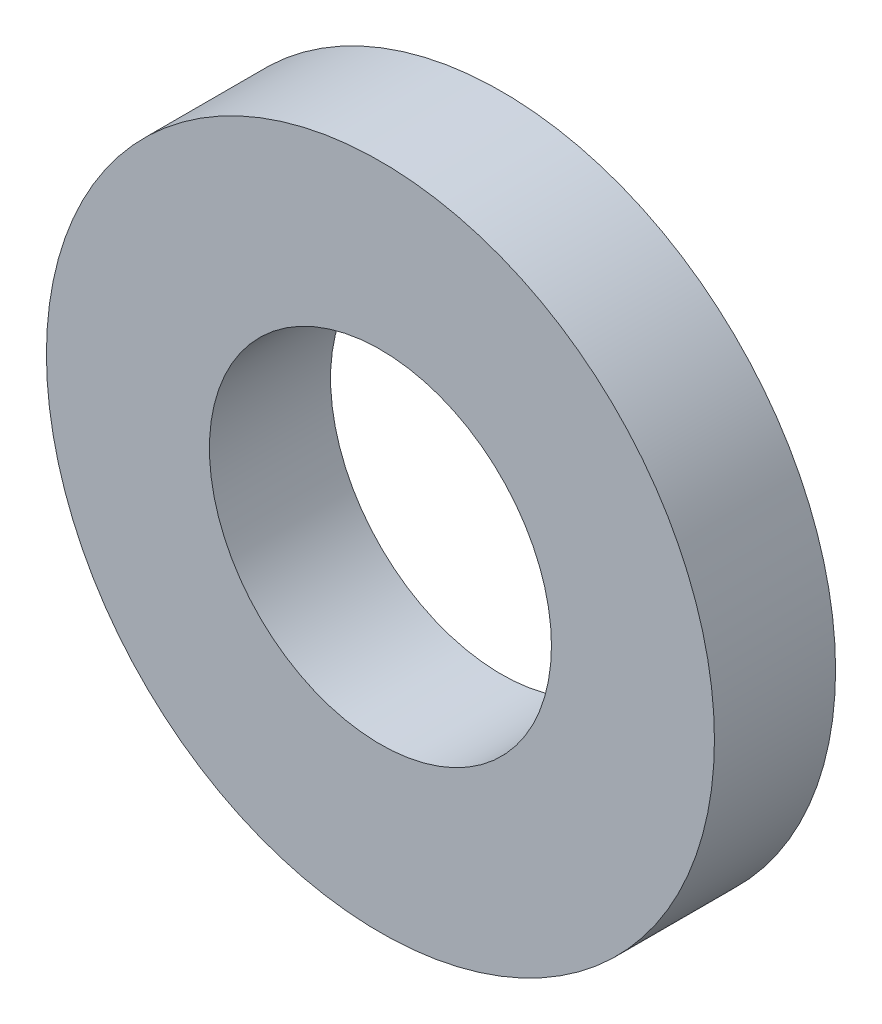
ISO-10303-21;
HEADER;
FILE_DESCRIPTION(('STEP AP214'),'2;1');
FILE_NAME('part.step','',(''),(''),'','','');
FILE_SCHEMA(('AUTOMOTIVE_DESIGN { 1 0 10303 214 1 1 1 1 }'));
ENDSEC;
DATA;
#1=APPLICATION_CONTEXT('core data for automotive mechanical design processes');
#2=APPLICATION_PROTOCOL_DEFINITION('international standard','automotive_design',2000,#1);
#3=PRODUCT_CONTEXT('',#1,'mechanical');
#4=PRODUCT('Part','Part','',(#3));
#5=PRODUCT_RELATED_PRODUCT_CATEGORY('part','',(#4));
#6=PRODUCT_DEFINITION_FORMATION('','',#4);
#7=PRODUCT_DEFINITION_CONTEXT('part definition',#1,'design');
#8=PRODUCT_DEFINITION('design','',#6,#7);
#9=PRODUCT_DEFINITION_SHAPE('','',#8);
#10=(LENGTH_UNIT() NAMED_UNIT(*) SI_UNIT(.MILLI.,.METRE.));
#11=(NAMED_UNIT(*) PLANE_ANGLE_UNIT() SI_UNIT($,.RADIAN.));
#12=(NAMED_UNIT(*) SI_UNIT($,.STERADIAN.) SOLID_ANGLE_UNIT());
#13=UNCERTAINTY_MEASURE_WITH_UNIT(LENGTH_MEASURE(1.E-05),#10,'distance_accuracy_value','');
#14=(GEOMETRIC_REPRESENTATION_CONTEXT(3) GLOBAL_UNCERTAINTY_ASSIGNED_CONTEXT((#13)) GLOBAL_UNIT_ASSIGNED_CONTEXT((#10,
#11,#12)) REPRESENTATION_CONTEXT('',''));
#15=CARTESIAN_POINT('',(0.,0.,0.));
#16=DIRECTION('',(0.,0.,1.));
#17=DIRECTION('',(1.,0.,0.));
#18=AXIS2_PLACEMENT_3D('',#15,#16,#17);
#19=CARTESIAN_POINT('',(0.,0.,-1.7272));
#20=DIRECTION('',(0.,0.,1.));
#21=DIRECTION('',(1.,0.,0.));
#22=AXIS2_PLACEMENT_3D('',#19,#20,#21);
#23=CYLINDRICAL_SURFACE('',#22,4.7625);
#24=CARTESIAN_POINT('',(0.,0.,-1.7272));
#25=DIRECTION('',(0.,0.,1.));
#26=DIRECTION('',(1.,0.,0.));
#27=AXIS2_PLACEMENT_3D('',#24,#25,#26);
#28=CIRCLE('',#27,4.7625);
#29=CARTESIAN_POINT('',(4.7625,0.,-1.7272));
#30=VERTEX_POINT('',#29);
#31=EDGE_CURVE('E12',#30,#30,#28,.T.);
#32=ORIENTED_EDGE('',*,*,#31,.T.);
#33=EDGE_LOOP('',(#32));
#34=FACE_BOUND('',#33,.T.);
#35=CARTESIAN_POINT('',(0.,0.,0.));
#36=DIRECTION('',(0.,0.,1.));
#37=DIRECTION('',(1.,0.,0.));
#38=AXIS2_PLACEMENT_3D('',#35,#36,#37);
#39=CIRCLE('',#38,4.7625);
#40=CARTESIAN_POINT('',(4.7625,0.,0.));
#41=VERTEX_POINT('',#40);
#42=EDGE_CURVE('E47',#41,#41,#39,.T.);
#43=ORIENTED_EDGE('',*,*,#42,.F.);
#44=EDGE_LOOP('',(#43));
#45=FACE_BOUND('',#44,.T.);
#46=ADVANCED_FACE('F44',(#34,#45),#23,.T.);
#47=CARTESIAN_POINT('',(0.,0.,-1.7272));
#48=DIRECTION('',(0.,0.,1.));
#49=DIRECTION('',(1.,0.,0.));
#50=AXIS2_PLACEMENT_3D('',#47,#48,#49);
#51=PLANE('',#50);
#52=CARTESIAN_POINT('',(0.,0.,-1.7272));
#53=DIRECTION('',(0.,0.,1.));
#54=DIRECTION('',(1.,0.,0.));
#55=AXIS2_PLACEMENT_3D('',#52,#53,#54);
#56=CIRCLE('',#55,2.4384);
#57=CARTESIAN_POINT('',(2.4384,0.,-1.7272));
#58=VERTEX_POINT('',#57);
#59=EDGE_CURVE('E54',#58,#58,#56,.T.);
#60=ORIENTED_EDGE('',*,*,#59,.T.);
#61=EDGE_LOOP('',(#60));
#62=FACE_BOUND('',#61,.T.);
#63=ORIENTED_EDGE('',*,*,#31,.F.);
#64=EDGE_LOOP('',(#63));
#65=FACE_BOUND('',#64,.T.);
#66=ADVANCED_FACE('F62',(#62,#65),#51,.F.);
#67=CARTESIAN_POINT('',(0.,0.,0.));
#68=DIRECTION('',(0.,0.,1.));
#69=DIRECTION('',(1.,0.,0.));
#70=AXIS2_PLACEMENT_3D('',#67,#68,#69);
#71=PLANE('',#70);
#72=CARTESIAN_POINT('',(0.,0.,0.));
#73=DIRECTION('',(0.,0.,1.));
#74=DIRECTION('',(1.,0.,0.));
#75=AXIS2_PLACEMENT_3D('',#72,#73,#74);
#76=CIRCLE('',#75,2.4384);
#77=CARTESIAN_POINT('',(2.4384,0.,0.));
#78=VERTEX_POINT('',#77);
#79=EDGE_CURVE('E56',#78,#78,#76,.T.);
#80=ORIENTED_EDGE('',*,*,#79,.F.);
#81=EDGE_LOOP('',(#80));
#82=FACE_BOUND('',#81,.T.);
#83=ORIENTED_EDGE('',*,*,#42,.T.);
#84=EDGE_LOOP('',(#83));
#85=FACE_BOUND('',#84,.T.);
#86=ADVANCED_FACE('F68',(#82,#85),#71,.T.);
#87=CARTESIAN_POINT('',(0.,0.,-1.7272));
#88=DIRECTION('',(0.,0.,1.));
#89=DIRECTION('',(1.,0.,0.));
#90=AXIS2_PLACEMENT_3D('',#87,#88,#89);
#91=CYLINDRICAL_SURFACE('',#90,2.4384);
#92=ORIENTED_EDGE('',*,*,#59,.F.);
#93=EDGE_LOOP('',(#92));
#94=FACE_BOUND('',#93,.T.);
#95=ORIENTED_EDGE('',*,*,#79,.T.);
#96=EDGE_LOOP('',(#95));
#97=FACE_BOUND('',#96,.T.);
#98=ADVANCED_FACE('F65',(#94,#97),#91,.F.);
#99=CLOSED_SHELL('',(#46,#66,#86,#98));
#100=MANIFOLD_SOLID_BREP('B2',#99);
#101=ADVANCED_BREP_SHAPE_REPRESENTATION('',(#18,#100),#14);
#102=SHAPE_DEFINITION_REPRESENTATION(#9,#101);
ENDSEC;
END-ISO-10303-21;
